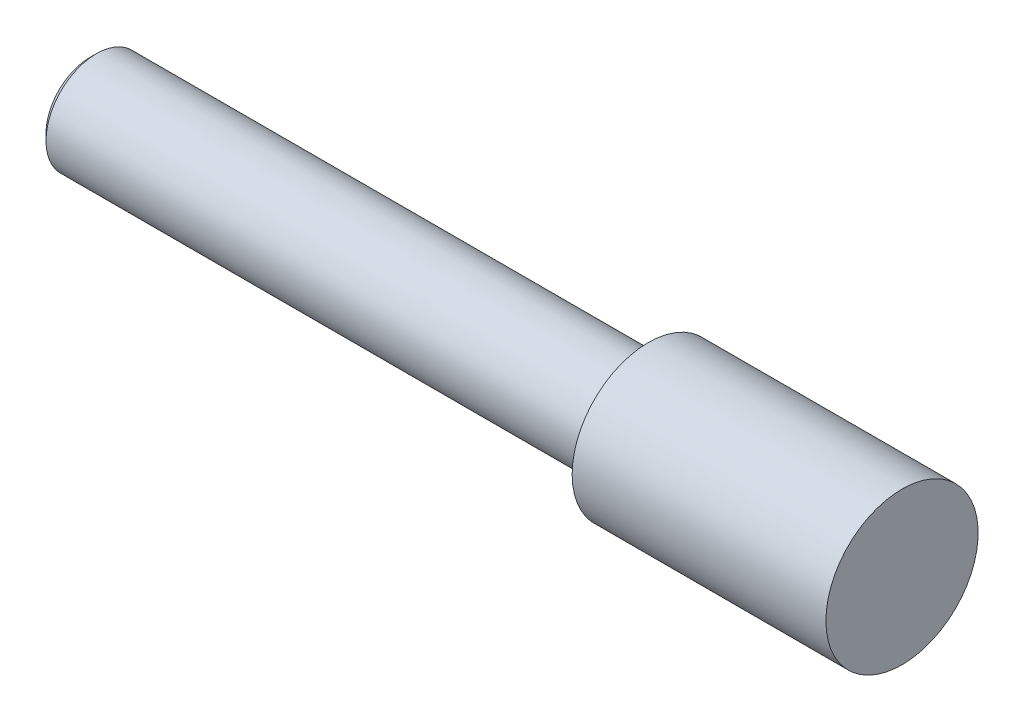
ISO-10303-21;
HEADER;
FILE_DESCRIPTION(('STEP AP214'),'2;1');
FILE_NAME('part.step','',(''),(''),'','','');
FILE_SCHEMA(('AUTOMOTIVE_DESIGN { 1 0 10303 214 1 1 1 1 }'));
ENDSEC;
DATA;
#1=APPLICATION_CONTEXT('core data for automotive mechanical design processes');
#2=APPLICATION_PROTOCOL_DEFINITION('international standard','automotive_design',2000,#1);
#3=PRODUCT_CONTEXT('',#1,'mechanical');
#4=PRODUCT('Part','Part','',(#3));
#5=PRODUCT_RELATED_PRODUCT_CATEGORY('part','',(#4));
#6=PRODUCT_DEFINITION_FORMATION('','',#4);
#7=PRODUCT_DEFINITION_CONTEXT('part definition',#1,'design');
#8=PRODUCT_DEFINITION('design','',#6,#7);
#9=PRODUCT_DEFINITION_SHAPE('','',#8);
#10=(LENGTH_UNIT() NAMED_UNIT(*) SI_UNIT(.MILLI.,.METRE.));
#11=(NAMED_UNIT(*) PLANE_ANGLE_UNIT() SI_UNIT($,.RADIAN.));
#12=(NAMED_UNIT(*) SI_UNIT($,.STERADIAN.) SOLID_ANGLE_UNIT());
#13=UNCERTAINTY_MEASURE_WITH_UNIT(LENGTH_MEASURE(1.E-05),#10,'distance_accuracy_value','');
#14=(GEOMETRIC_REPRESENTATION_CONTEXT(3) GLOBAL_UNCERTAINTY_ASSIGNED_CONTEXT((#13)) GLOBAL_UNIT_ASSIGNED_CONTEXT((#10,
#11,#12)) REPRESENTATION_CONTEXT('',''));
#15=CARTESIAN_POINT('',(0.,0.,0.));
#16=DIRECTION('',(0.,0.,1.));
#17=DIRECTION('',(1.,0.,0.));
#18=AXIS2_PLACEMENT_3D('',#15,#16,#17);
#19=CARTESIAN_POINT('',(16.,0.,0.));
#20=DIRECTION('',(-1.,0.,0.));
#21=DIRECTION('',(0.,0.,1.));
#22=AXIS2_PLACEMENT_3D('',#19,#20,#21);
#23=PLANE('',#22);
#24=CARTESIAN_POINT('',(16.,0.,0.));
#25=DIRECTION('',(-1.,0.,0.));
#26=DIRECTION('',(0.,0.,1.));
#27=AXIS2_PLACEMENT_3D('',#24,#25,#26);
#28=CIRCLE('',#27,3.);
#29=CARTESIAN_POINT('',(16.,0.,3.));
#30=VERTEX_POINT('',#29);
#31=EDGE_CURVE('E17',#30,#30,#28,.T.);
#32=ORIENTED_EDGE('',*,*,#31,.F.);
#33=EDGE_LOOP('',(#32));
#34=FACE_BOUND('',#33,.T.);
#35=ADVANCED_FACE('F14',(#34),#23,.F.);
#36=CARTESIAN_POINT('',(0.,0.,0.));
#37=DIRECTION('',(-1.,0.,0.));
#38=DIRECTION('',(0.,0.,1.));
#39=AXIS2_PLACEMENT_3D('',#36,#37,#38);
#40=CYLINDRICAL_SURFACE('',#39,3.);
#41=CARTESIAN_POINT('',(5.99999999997181,0.,0.));
#42=DIRECTION('',(1.,0.,0.));
#43=DIRECTION('',(0.,0.,-1.));
#44=AXIS2_PLACEMENT_3D('',#41,#42,#43);
#45=CIRCLE('',#44,2.9999999999859);
#46=CARTESIAN_POINT('',(5.99999999997181,0.,-2.9999999999859));
#47=VERTEX_POINT('',#46);
#48=EDGE_CURVE('E29',#47,#47,#45,.F.);
#49=ORIENTED_EDGE('',*,*,#48,.F.);
#50=EDGE_LOOP('',(#49));
#51=FACE_BOUND('',#50,.T.);
#52=ORIENTED_EDGE('',*,*,#31,.T.);
#53=EDGE_LOOP('',(#52));
#54=FACE_BOUND('',#53,.T.);
#55=ADVANCED_FACE('F39',(#51,#54),#40,.T.);
#56=CARTESIAN_POINT('',(-16.,1.984375,0.));
#57=DIRECTION('',(1.,0.,0.));
#58=DIRECTION('',(0.,0.,-1.));
#59=AXIS2_PLACEMENT_3D('',#56,#57,#58);
#60=PLANE('',#59);
#61=CARTESIAN_POINT('',(-16.0000000000196,0.,0.));
#62=DIRECTION('',(1.,0.,0.));
#63=DIRECTION('',(0.,0.,-1.));
#64=AXIS2_PLACEMENT_3D('',#61,#62,#63);
#65=CIRCLE('',#64,1.73437500006912);
#66=CARTESIAN_POINT('',(-16.0000000000196,0.,-1.73437500006912));
#67=VERTEX_POINT('',#66);
#68=EDGE_CURVE('E26',#67,#67,#65,.T.);
#69=ORIENTED_EDGE('',*,*,#68,.F.);
#70=EDGE_LOOP('',(#69));
#71=FACE_BOUND('',#70,.T.);
#72=ADVANCED_FACE('F36',(#71),#60,.F.);
#73=CARTESIAN_POINT('',(5.99999999985812,0.,0.));
#74=DIRECTION('',(1.,0.,0.));
#75=DIRECTION('',(0.,0.,-1.));
#76=AXIS2_PLACEMENT_3D('',#73,#74,#75);
#77=CONICAL_SURFACE('',#76,2.99999999975853,1.0471975511856);
#78=ORIENTED_EDGE('',*,*,#48,.T.);
#79=EDGE_LOOP('',(#78));
#80=FACE_BOUND('',#79,.T.);
#81=CARTESIAN_POINT('',(5.41362863285429,0.,0.));
#82=DIRECTION('',(-1.,0.,0.));
#83=DIRECTION('',(0.,0.,1.));
#84=AXIS2_PLACEMENT_3D('',#81,#82,#83);
#85=CIRCLE('',#84,1.984375);
#86=CARTESIAN_POINT('',(5.41362863285429,0.,1.984375));
#87=VERTEX_POINT('',#86);
#88=EDGE_CURVE('E21',#87,#87,#85,.T.);
#89=ORIENTED_EDGE('',*,*,#88,.F.);
#90=EDGE_LOOP('',(#89));
#91=FACE_BOUND('',#90,.T.);
#92=ADVANCED_FACE('F38',(#80,#91),#77,.T.);
#93=CARTESIAN_POINT('',(-15.7500000001392,0.,0.));
#94=DIRECTION('',(1.,0.,0.));
#95=DIRECTION('',(0.,0.,-1.));
#96=AXIS2_PLACEMENT_3D('',#93,#94,#95);
#97=CONICAL_SURFACE('',#96,1.98437499994952,0.785398163397448);
#98=CARTESIAN_POINT('',(-15.75,0.,0.));
#99=DIRECTION('',(-1.,0.,0.));
#100=DIRECTION('',(0.,0.,1.));
#101=AXIS2_PLACEMENT_3D('',#98,#99,#100);
#102=CIRCLE('',#101,1.984375);
#103=CARTESIAN_POINT('',(-15.75,0.,1.984375));
#104=VERTEX_POINT('',#103);
#105=EDGE_CURVE('E9',#104,#104,#102,.F.);
#106=ORIENTED_EDGE('',*,*,#105,.F.);
#107=EDGE_LOOP('',(#106));
#108=FACE_BOUND('',#107,.T.);
#109=ORIENTED_EDGE('',*,*,#68,.T.);
#110=EDGE_LOOP('',(#109));
#111=FACE_BOUND('',#110,.T.);
#112=ADVANCED_FACE('F34',(#108,#111),#97,.T.);
#113=CARTESIAN_POINT('',(0.,0.,0.));
#114=DIRECTION('',(-1.,0.,0.));
#115=DIRECTION('',(0.,0.,1.));
#116=AXIS2_PLACEMENT_3D('',#113,#114,#115);
#117=CYLINDRICAL_SURFACE('',#116,1.984375);
#118=ORIENTED_EDGE('',*,*,#105,.T.);
#119=EDGE_LOOP('',(#118));
#120=FACE_BOUND('',#119,.T.);
#121=ORIENTED_EDGE('',*,*,#88,.T.);
#122=EDGE_LOOP('',(#121));
#123=FACE_BOUND('',#122,.T.);
#124=ADVANCED_FACE('F49',(#120,#123),#117,.T.);
#125=CLOSED_SHELL('',(#35,#55,#72,#92,#112,#124));
#126=MANIFOLD_SOLID_BREP('B1',#125);
#127=ADVANCED_BREP_SHAPE_REPRESENTATION('',(#18,#126),#14);
#128=SHAPE_DEFINITION_REPRESENTATION(#9,#127);
ENDSEC;
END-ISO-10303-21;
